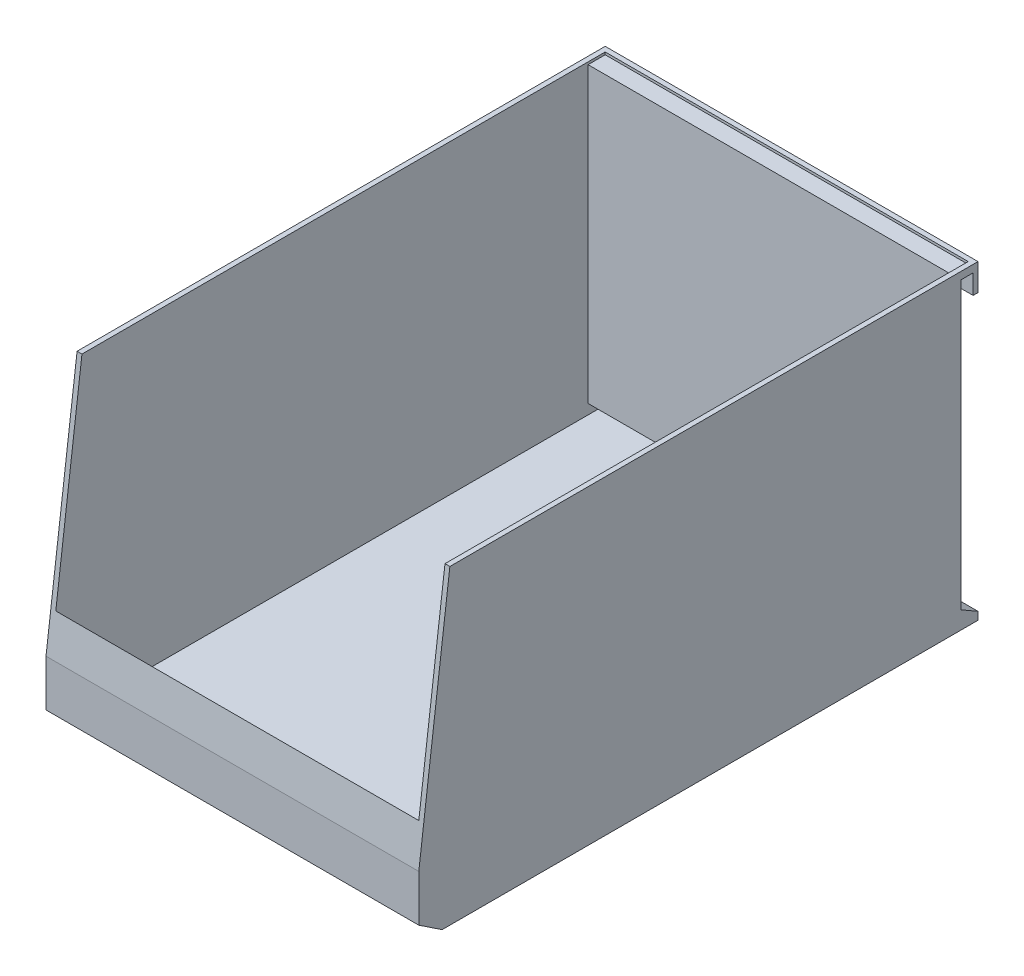
ISO-10303-21;
HEADER;
FILE_DESCRIPTION(('STEP AP214'),'2;1');
FILE_NAME('part.step','',(''),(''),'','','');
FILE_SCHEMA(('AUTOMOTIVE_DESIGN { 1 0 10303 214 1 1 1 1 }'));
ENDSEC;
DATA;
#1=APPLICATION_CONTEXT('core data for automotive mechanical design processes');
#2=APPLICATION_PROTOCOL_DEFINITION('international standard','automotive_design',2000,#1);
#3=PRODUCT_CONTEXT('',#1,'mechanical');
#4=PRODUCT('Part','Part','',(#3));
#5=PRODUCT_RELATED_PRODUCT_CATEGORY('part','',(#4));
#6=PRODUCT_DEFINITION_FORMATION('','',#4);
#7=PRODUCT_DEFINITION_CONTEXT('part definition',#1,'design');
#8=PRODUCT_DEFINITION('design','',#6,#7);
#9=PRODUCT_DEFINITION_SHAPE('','',#8);
#10=(LENGTH_UNIT() NAMED_UNIT(*) SI_UNIT(.MILLI.,.METRE.));
#11=(NAMED_UNIT(*) PLANE_ANGLE_UNIT() SI_UNIT($,.RADIAN.));
#12=(NAMED_UNIT(*) SI_UNIT($,.STERADIAN.) SOLID_ANGLE_UNIT());
#13=UNCERTAINTY_MEASURE_WITH_UNIT(LENGTH_MEASURE(1.E-05),#10,'distance_accuracy_value','');
#14=(GEOMETRIC_REPRESENTATION_CONTEXT(3) GLOBAL_UNCERTAINTY_ASSIGNED_CONTEXT((#13)) GLOBAL_UNIT_ASSIGNED_CONTEXT((#10,
#11,#12)) REPRESENTATION_CONTEXT('',''));
#15=CARTESIAN_POINT('',(0.,0.,0.));
#16=DIRECTION('',(0.,0.,1.));
#17=DIRECTION('',(1.,0.,0.));
#18=AXIS2_PLACEMENT_3D('',#15,#16,#17);
#19=CARTESIAN_POINT('',(0.,127.,0.));
#20=DIRECTION('',(0.,-1.,0.));
#21=DIRECTION('',(0.,0.,-1.));
#22=AXIS2_PLACEMENT_3D('',#19,#20,#21);
#23=PLANE('',#22);
#24=DIRECTION('',(0.,0.,1.));
#25=VECTOR('',#24,1.);
#26=CARTESIAN_POINT('',(-74.2,127.,0.));
#27=LINE('',#26,#25);
#28=CARTESIAN_POINT('',(-74.2,127.,-112.3));
#29=VERTEX_POINT('',#28);
#30=CARTESIAN_POINT('',(-74.2,127.,101.6));
#31=VERTEX_POINT('',#30);
#32=EDGE_CURVE('E205',#29,#31,#27,.T.);
#33=ORIENTED_EDGE('',*,*,#32,.F.);
#34=DIRECTION('',(-1.,0.,0.));
#35=VECTOR('',#34,1.);
#36=CARTESIAN_POINT('',(0.,127.,-112.3));
#37=LINE('',#36,#35);
#38=CARTESIAN_POINT('',(74.2,127.,-112.3));
#39=VERTEX_POINT('',#38);
#40=EDGE_CURVE('E209',#39,#29,#37,.T.);
#41=ORIENTED_EDGE('',*,*,#40,.F.);
#42=DIRECTION('',(0.,0.,-1.));
#43=VECTOR('',#42,1.);
#44=CARTESIAN_POINT('',(74.2,127.,0.));
#45=LINE('',#44,#43);
#46=CARTESIAN_POINT('',(74.2,127.,101.6));
#47=VERTEX_POINT('',#46);
#48=EDGE_CURVE('E245',#47,#39,#45,.T.);
#49=ORIENTED_EDGE('',*,*,#48,.F.);
#50=DIRECTION('',(1.,0.,0.));
#51=VECTOR('',#50,1.);
#52=CARTESIAN_POINT('',(-76.2,127.,101.6));
#53=LINE('',#52,#51);
#54=CARTESIAN_POINT('',(76.2,127.,101.6));
#55=VERTEX_POINT('',#54);
#56=EDGE_CURVE('E314',#47,#55,#53,.T.);
#57=ORIENTED_EDGE('',*,*,#56,.T.);
#58=DIRECTION('',(0.,0.,-1.));
#59=VECTOR('',#58,1.);
#60=CARTESIAN_POINT('',(76.2,127.,114.3));
#61=LINE('',#60,#59);
#62=CARTESIAN_POINT('',(76.2,127.,-114.3));
#63=VERTEX_POINT('',#62);
#64=EDGE_CURVE('E324',#55,#63,#61,.T.);
#65=ORIENTED_EDGE('',*,*,#64,.T.);
#66=DIRECTION('',(-1.,0.,0.));
#67=VECTOR('',#66,1.);
#68=CARTESIAN_POINT('',(-76.2,127.,-114.3));
#69=LINE('',#68,#67);
#70=CARTESIAN_POINT('',(-76.2,127.,-114.3));
#71=VERTEX_POINT('',#70);
#72=EDGE_CURVE('E326',#63,#71,#69,.T.);
#73=ORIENTED_EDGE('',*,*,#72,.T.);
#74=DIRECTION('',(0.,0.,1.));
#75=VECTOR('',#74,1.);
#76=CARTESIAN_POINT('',(-76.2,127.,114.3));
#77=LINE('',#76,#75);
#78=CARTESIAN_POINT('',(-76.2,127.,101.6));
#79=VERTEX_POINT('',#78);
#80=EDGE_CURVE('E329',#71,#79,#77,.T.);
#81=ORIENTED_EDGE('',*,*,#80,.T.);
#82=EDGE_CURVE('E310',#79,#31,#53,.T.);
#83=ORIENTED_EDGE('',*,*,#82,.T.);
#84=EDGE_LOOP('',(#33,#41,#49,#57,#65,#73,#81,#83));
#85=FACE_BOUND('',#84,.T.);
#86=ADVANCED_FACE('F33',(#85),#23,.F.);
#87=CARTESIAN_POINT('',(-76.2,127.,101.6));
#88=DIRECTION('',(0.,-0.124034734589209,-0.992277876713668));
#89=DIRECTION('',(0.,0.992277876713668,-0.124034734589209));
#90=AXIS2_PLACEMENT_3D('',#87,#88,#89);
#91=PLANE('',#90);
#92=DIRECTION('',(0.,0.992277876713668,-0.124034734589209));
#93=VECTOR('',#92,1.);
#94=CARTESIAN_POINT('',(74.2,127.,101.6));
#95=LINE('',#94,#93);
#96=CARTESIAN_POINT('',(74.2,41.4000000000001,112.3));
#97=VERTEX_POINT('',#96);
#98=EDGE_CURVE('E248',#97,#47,#95,.T.);
#99=ORIENTED_EDGE('',*,*,#98,.F.);
#100=DIRECTION('',(1.,0.,0.));
#101=VECTOR('',#100,1.);
#102=CARTESIAN_POINT('',(-76.2,41.4000000000001,112.3));
#103=LINE('',#102,#101);
#104=CARTESIAN_POINT('',(-74.2,41.4000000000001,112.3));
#105=VERTEX_POINT('',#104);
#106=EDGE_CURVE('E204',#105,#97,#103,.T.);
#107=ORIENTED_EDGE('',*,*,#106,.F.);
#108=DIRECTION('',(0.,0.992277876713668,-0.124034734589209));
#109=VECTOR('',#108,1.);
#110=CARTESIAN_POINT('',(-74.2,125.436923076923,101.795384615385));
#111=LINE('',#110,#109);
#112=EDGE_CURVE('E252',#105,#31,#111,.T.);
#113=ORIENTED_EDGE('',*,*,#112,.T.);
#114=ORIENTED_EDGE('',*,*,#82,.F.);
#115=DIRECTION('',(0.,0.992277876713668,-0.124034734589209));
#116=VECTOR('',#115,1.);
#117=CARTESIAN_POINT('',(-76.2,127.,101.6));
#118=LINE('',#117,#116);
#119=CARTESIAN_POINT('',(-76.2,25.4,114.3));
#120=VERTEX_POINT('',#119);
#121=EDGE_CURVE('E302',#120,#79,#118,.T.);
#122=ORIENTED_EDGE('',*,*,#121,.F.);
#123=DIRECTION('',(1.,0.,0.));
#124=VECTOR('',#123,1.);
#125=CARTESIAN_POINT('',(-76.2,25.4,114.3));
#126=LINE('',#125,#124);
#127=CARTESIAN_POINT('',(76.2,25.4,114.3));
#128=VERTEX_POINT('',#127);
#129=EDGE_CURVE('E305',#120,#128,#126,.T.);
#130=ORIENTED_EDGE('',*,*,#129,.T.);
#131=DIRECTION('',(0.,0.992277876713668,-0.124034734589209));
#132=VECTOR('',#131,1.);
#133=CARTESIAN_POINT('',(76.2,127.,101.6));
#134=LINE('',#133,#132);
#135=EDGE_CURVE('E306',#128,#55,#134,.T.);
#136=ORIENTED_EDGE('',*,*,#135,.T.);
#137=ORIENTED_EDGE('',*,*,#56,.F.);
#138=EDGE_LOOP('',(#99,#107,#113,#114,#122,#130,#136,#137));
#139=FACE_BOUND('',#138,.T.);
#140=ADVANCED_FACE('F407',(#139),#91,.F.);
#141=CARTESIAN_POINT('',(-76.2,127.,-114.3));
#142=DIRECTION('',(0.,0.,1.));
#143=DIRECTION('',(1.,0.,0.));
#144=AXIS2_PLACEMENT_3D('',#141,#142,#143);
#145=PLANE('',#144);
#146=DIRECTION('',(0.,-1.,0.));
#147=VECTOR('',#146,1.);
#148=CARTESIAN_POINT('',(76.2,127.,-114.3));
#149=LINE('',#148,#147);
#150=CARTESIAN_POINT('',(76.2,116.,-114.3));
#151=VERTEX_POINT('',#150);
#152=EDGE_CURVE('E11',#63,#151,#149,.T.);
#153=ORIENTED_EDGE('',*,*,#152,.T.);
#154=DIRECTION('',(1.,0.,0.));
#155=VECTOR('',#154,1.);
#156=CARTESIAN_POINT('',(-76.2,116.,-114.3));
#157=LINE('',#156,#155);
#158=CARTESIAN_POINT('',(-76.2,116.,-114.3));
#159=VERTEX_POINT('',#158);
#160=EDGE_CURVE('E296',#159,#151,#157,.T.);
#161=ORIENTED_EDGE('',*,*,#160,.F.);
#162=DIRECTION('',(0.,-1.,0.));
#163=VECTOR('',#162,1.);
#164=CARTESIAN_POINT('',(-76.2,127.,-114.3));
#165=LINE('',#164,#163);
#166=EDGE_CURVE('E345',#71,#159,#165,.T.);
#167=ORIENTED_EDGE('',*,*,#166,.F.);
#168=ORIENTED_EDGE('',*,*,#72,.F.);
#169=EDGE_LOOP('',(#153,#161,#167,#168));
#170=FACE_BOUND('',#169,.T.);
#171=ADVANCED_FACE('F380',(#170),#145,.F.);
#172=CARTESIAN_POINT('',(76.2,127.,114.3));
#173=DIRECTION('',(-1.,0.,0.));
#174=DIRECTION('',(0.,0.,1.));
#175=AXIS2_PLACEMENT_3D('',#172,#173,#174);
#176=PLANE('',#175);
#177=DIRECTION('',(0.,1.,0.));
#178=VECTOR('',#177,1.);
#179=CARTESIAN_POINT('',(76.2,124.,-112.3));
#180=LINE('',#179,#178);
#181=CARTESIAN_POINT('',(76.2,116.,-112.3));
#182=VERTEX_POINT('',#181);
#183=CARTESIAN_POINT('',(76.2,124.,-112.3));
#184=VERTEX_POINT('',#183);
#185=EDGE_CURVE('E284',#182,#184,#180,.T.);
#186=ORIENTED_EDGE('',*,*,#185,.F.);
#187=DIRECTION('',(0.,0.,1.));
#188=VECTOR('',#187,1.);
#189=CARTESIAN_POINT('',(76.2,116.,-112.3));
#190=LINE('',#189,#188);
#191=EDGE_CURVE('E281',#151,#182,#190,.T.);
#192=ORIENTED_EDGE('',*,*,#191,.F.);
#193=ORIENTED_EDGE('',*,*,#152,.F.);
#194=ORIENTED_EDGE('',*,*,#64,.F.);
#195=ORIENTED_EDGE('',*,*,#135,.F.);
#196=DIRECTION('',(0.,-1.,0.));
#197=VECTOR('',#196,1.);
#198=CARTESIAN_POINT('',(76.2,127.,114.3));
#199=LINE('',#198,#197);
#200=CARTESIAN_POINT('',(76.2,6.35,114.3));
#201=VERTEX_POINT('',#200);
#202=EDGE_CURVE('E332',#128,#201,#199,.T.);
#203=ORIENTED_EDGE('',*,*,#202,.T.);
#204=DIRECTION('',(0.,0.554700196225228,0.832050294337844));
#205=VECTOR('',#204,1.);
#206=CARTESIAN_POINT('',(76.2,6.35,114.3));
#207=LINE('',#206,#205);
#208=CARTESIAN_POINT('',(76.2,0.,104.775));
#209=VERTEX_POINT('',#208);
#210=EDGE_CURVE('E291',#209,#201,#207,.T.);
#211=ORIENTED_EDGE('',*,*,#210,.F.);
#212=DIRECTION('',(0.,0.,-1.));
#213=VECTOR('',#212,1.);
#214=CARTESIAN_POINT('',(76.2,0.,114.3));
#215=LINE('',#214,#213);
#216=CARTESIAN_POINT('',(76.2,0.,-114.3));
#217=VERTEX_POINT('',#216);
#218=EDGE_CURVE('E313',#209,#217,#215,.T.);
#219=ORIENTED_EDGE('',*,*,#218,.T.);
#220=CARTESIAN_POINT('',(76.2,3.175,-114.3));
#221=VERTEX_POINT('',#220);
#222=EDGE_CURVE('E41',#221,#217,#149,.T.);
#223=ORIENTED_EDGE('',*,*,#222,.F.);
#224=DIRECTION('',(0.,-0.499999999999995,-0.866025403784442));
#225=VECTOR('',#224,1.);
#226=CARTESIAN_POINT('',(76.2,7.21645188432733,-107.3));
#227=LINE('',#226,#225);
#228=CARTESIAN_POINT('',(76.2,7.21645188432733,-107.3));
#229=VERTEX_POINT('',#228);
#230=EDGE_CURVE('E279',#229,#221,#227,.T.);
#231=ORIENTED_EDGE('',*,*,#230,.F.);
#232=DIRECTION('',(0.,-1.,0.));
#233=VECTOR('',#232,1.);
#234=CARTESIAN_POINT('',(76.2,7.21645188432733,-107.3));
#235=LINE('',#234,#233);
#236=CARTESIAN_POINT('',(76.2,124.,-107.3));
#237=VERTEX_POINT('',#236);
#238=EDGE_CURVE('E261',#237,#229,#235,.T.);
#239=ORIENTED_EDGE('',*,*,#238,.F.);
#240=DIRECTION('',(0.,0.,1.));
#241=VECTOR('',#240,1.);
#242=CARTESIAN_POINT('',(76.2,124.,-107.3));
#243=LINE('',#242,#241);
#244=EDGE_CURVE('E265',#184,#237,#243,.T.);
#245=ORIENTED_EDGE('',*,*,#244,.F.);
#246=EDGE_LOOP('',(#186,#192,#193,#194,#195,#203,#211,#219,#223,#231,#239,#245));
#247=FACE_BOUND('',#246,.T.);
#248=ADVANCED_FACE('F35',(#247),#176,.F.);
#249=CARTESIAN_POINT('',(-76.2,3.175,-114.3));
#250=VERTEX_POINT('',#249);
#251=CARTESIAN_POINT('',(-76.2,0.,-114.3));
#252=VERTEX_POINT('',#251);
#253=EDGE_CURVE('E344',#250,#252,#165,.T.);
#254=ORIENTED_EDGE('',*,*,#253,.F.);
#255=DIRECTION('',(1.,0.,0.));
#256=VECTOR('',#255,1.);
#257=CARTESIAN_POINT('',(-76.2,3.175,-114.3));
#258=LINE('',#257,#256);
#259=EDGE_CURVE('E298',#250,#221,#258,.T.);
#260=ORIENTED_EDGE('',*,*,#259,.T.);
#261=ORIENTED_EDGE('',*,*,#222,.T.);
#262=DIRECTION('',(-1.,0.,0.));
#263=VECTOR('',#262,1.);
#264=CARTESIAN_POINT('',(-76.2,0.,-114.3));
#265=LINE('',#264,#263);
#266=EDGE_CURVE('E335',#217,#252,#265,.T.);
#267=ORIENTED_EDGE('',*,*,#266,.T.);
#268=EDGE_LOOP('',(#254,#260,#261,#267));
#269=FACE_BOUND('',#268,.T.);
#270=ADVANCED_FACE('F355',(#269),#145,.F.);
#271=CARTESIAN_POINT('',(-76.2,127.,114.3));
#272=DIRECTION('',(1.,0.,0.));
#273=DIRECTION('',(0.,0.,-1.));
#274=AXIS2_PLACEMENT_3D('',#271,#272,#273);
#275=PLANE('',#274);
#276=ORIENTED_EDGE('',*,*,#166,.T.);
#277=DIRECTION('',(0.,0.,1.));
#278=VECTOR('',#277,1.);
#279=CARTESIAN_POINT('',(-76.2,116.,-112.3));
#280=LINE('',#279,#278);
#281=CARTESIAN_POINT('',(-76.2,116.,-112.3));
#282=VERTEX_POINT('',#281);
#283=EDGE_CURVE('E267',#159,#282,#280,.T.);
#284=ORIENTED_EDGE('',*,*,#283,.T.);
#285=DIRECTION('',(0.,1.,0.));
#286=VECTOR('',#285,1.);
#287=CARTESIAN_POINT('',(-76.2,124.,-112.3));
#288=LINE('',#287,#286);
#289=CARTESIAN_POINT('',(-76.2,124.,-112.3));
#290=VERTEX_POINT('',#289);
#291=EDGE_CURVE('E270',#282,#290,#288,.T.);
#292=ORIENTED_EDGE('',*,*,#291,.T.);
#293=DIRECTION('',(0.,0.,1.));
#294=VECTOR('',#293,1.);
#295=CARTESIAN_POINT('',(-76.2,124.,-107.3));
#296=LINE('',#295,#294);
#297=CARTESIAN_POINT('',(-76.2,124.,-107.3));
#298=VERTEX_POINT('',#297);
#299=EDGE_CURVE('E273',#290,#298,#296,.T.);
#300=ORIENTED_EDGE('',*,*,#299,.T.);
#301=DIRECTION('',(0.,-1.,0.));
#302=VECTOR('',#301,1.);
#303=CARTESIAN_POINT('',(-76.2,116.,-107.3));
#304=LINE('',#303,#302);
#305=CARTESIAN_POINT('',(-76.2,7.21645188432733,-107.3));
#306=VERTEX_POINT('',#305);
#307=EDGE_CURVE('E262',#298,#306,#304,.T.);
#308=ORIENTED_EDGE('',*,*,#307,.T.);
#309=DIRECTION('',(0.,-0.499999999999995,-0.866025403784442));
#310=VECTOR('',#309,1.);
#311=CARTESIAN_POINT('',(-76.2,7.21645188432733,-107.3));
#312=LINE('',#311,#310);
#313=EDGE_CURVE('E56',#306,#250,#312,.T.);
#314=ORIENTED_EDGE('',*,*,#313,.T.);
#315=ORIENTED_EDGE('',*,*,#253,.T.);
#316=DIRECTION('',(0.,0.,1.));
#317=VECTOR('',#316,1.);
#318=CARTESIAN_POINT('',(-76.2,0.,114.3));
#319=LINE('',#318,#317);
#320=CARTESIAN_POINT('',(-76.2,0.,104.775));
#321=VERTEX_POINT('',#320);
#322=EDGE_CURVE('E327',#252,#321,#319,.T.);
#323=ORIENTED_EDGE('',*,*,#322,.T.);
#324=DIRECTION('',(0.,0.554700196225228,0.832050294337844));
#325=VECTOR('',#324,1.);
#326=CARTESIAN_POINT('',(-76.2,6.35,114.3));
#327=LINE('',#326,#325);
#328=CARTESIAN_POINT('',(-76.2,6.35,114.3));
#329=VERTEX_POINT('',#328);
#330=EDGE_CURVE('E316',#321,#329,#327,.T.);
#331=ORIENTED_EDGE('',*,*,#330,.T.);
#332=DIRECTION('',(0.,-1.,0.));
#333=VECTOR('',#332,1.);
#334=CARTESIAN_POINT('',(-76.2,127.,114.3));
#335=LINE('',#334,#333);
#336=EDGE_CURVE('E342',#120,#329,#335,.T.);
#337=ORIENTED_EDGE('',*,*,#336,.F.);
#338=ORIENTED_EDGE('',*,*,#121,.T.);
#339=ORIENTED_EDGE('',*,*,#80,.F.);
#340=EDGE_LOOP('',(#276,#284,#292,#300,#308,#314,#315,#323,#331,#337,#338,#339));
#341=FACE_BOUND('',#340,.T.);
#342=ADVANCED_FACE('F351',(#341),#275,.F.);
#343=CARTESIAN_POINT('',(-76.2,127.,114.3));
#344=DIRECTION('',(0.,0.,-1.));
#345=DIRECTION('',(-1.,0.,0.));
#346=AXIS2_PLACEMENT_3D('',#343,#344,#345);
#347=PLANE('',#346);
#348=ORIENTED_EDGE('',*,*,#202,.F.);
#349=ORIENTED_EDGE('',*,*,#129,.F.);
#350=ORIENTED_EDGE('',*,*,#336,.T.);
#351=DIRECTION('',(1.,0.,0.));
#352=VECTOR('',#351,1.);
#353=CARTESIAN_POINT('',(-76.2,6.35,114.3));
#354=LINE('',#353,#352);
#355=EDGE_CURVE('E319',#329,#201,#354,.T.);
#356=ORIENTED_EDGE('',*,*,#355,.T.);
#357=EDGE_LOOP('',(#348,#349,#350,#356));
#358=FACE_BOUND('',#357,.T.);
#359=ADVANCED_FACE('F371',(#358),#347,.F.);
#360=CARTESIAN_POINT('',(0.,0.,0.));
#361=DIRECTION('',(0.,-1.,0.));
#362=DIRECTION('',(0.,0.,-1.));
#363=AXIS2_PLACEMENT_3D('',#360,#361,#362);
#364=PLANE('',#363);
#365=DIRECTION('',(1.,0.,0.));
#366=VECTOR('',#365,1.);
#367=CARTESIAN_POINT('',(-76.2,0.,104.775));
#368=LINE('',#367,#366);
#369=EDGE_CURVE('E309',#321,#209,#368,.T.);
#370=ORIENTED_EDGE('',*,*,#369,.F.);
#371=ORIENTED_EDGE('',*,*,#322,.F.);
#372=ORIENTED_EDGE('',*,*,#266,.F.);
#373=ORIENTED_EDGE('',*,*,#218,.F.);
#374=EDGE_LOOP('',(#370,#371,#372,#373));
#375=FACE_BOUND('',#374,.T.);
#376=ADVANCED_FACE('F360',(#375),#364,.T.);
#377=CARTESIAN_POINT('',(-76.2,6.35,114.3));
#378=DIRECTION('',(0.,0.832050294337844,-0.554700196225228));
#379=DIRECTION('',(0.,0.554700196225228,0.832050294337844));
#380=AXIS2_PLACEMENT_3D('',#377,#378,#379);
#381=PLANE('',#380);
#382=ORIENTED_EDGE('',*,*,#210,.T.);
#383=ORIENTED_EDGE('',*,*,#355,.F.);
#384=ORIENTED_EDGE('',*,*,#330,.F.);
#385=ORIENTED_EDGE('',*,*,#369,.T.);
#386=EDGE_LOOP('',(#382,#383,#384,#385));
#387=FACE_BOUND('',#386,.T.);
#388=ADVANCED_FACE('F363',(#387),#381,.F.);
#389=CARTESIAN_POINT('',(-76.2,124.,-107.3));
#390=DIRECTION('',(0.,1.,0.));
#391=DIRECTION('',(0.,0.,1.));
#392=AXIS2_PLACEMENT_3D('',#389,#390,#391);
#393=PLANE('',#392);
#394=ORIENTED_EDGE('',*,*,#244,.T.);
#395=DIRECTION('',(1.,0.,0.));
#396=VECTOR('',#395,1.);
#397=CARTESIAN_POINT('',(-76.2,124.,-107.3));
#398=LINE('',#397,#396);
#399=EDGE_CURVE('E289',#298,#237,#398,.T.);
#400=ORIENTED_EDGE('',*,*,#399,.F.);
#401=ORIENTED_EDGE('',*,*,#299,.F.);
#402=DIRECTION('',(1.,0.,0.));
#403=VECTOR('',#402,1.);
#404=CARTESIAN_POINT('',(-76.2,124.,-112.3));
#405=LINE('',#404,#403);
#406=EDGE_CURVE('E292',#290,#184,#405,.T.);
#407=ORIENTED_EDGE('',*,*,#406,.T.);
#408=EDGE_LOOP('',(#394,#400,#401,#407));
#409=FACE_BOUND('',#408,.T.);
#410=ADVANCED_FACE('F392',(#409),#393,.F.);
#411=CARTESIAN_POINT('',(-76.2,124.,-112.3));
#412=DIRECTION('',(0.,0.,-1.));
#413=DIRECTION('',(-1.,0.,0.));
#414=AXIS2_PLACEMENT_3D('',#411,#412,#413);
#415=PLANE('',#414);
#416=ORIENTED_EDGE('',*,*,#185,.T.);
#417=ORIENTED_EDGE('',*,*,#406,.F.);
#418=ORIENTED_EDGE('',*,*,#291,.F.);
#419=DIRECTION('',(1.,0.,0.));
#420=VECTOR('',#419,1.);
#421=CARTESIAN_POINT('',(-76.2,116.,-112.3));
#422=LINE('',#421,#420);
#423=EDGE_CURVE('E294',#282,#182,#422,.T.);
#424=ORIENTED_EDGE('',*,*,#423,.T.);
#425=EDGE_LOOP('',(#416,#417,#418,#424));
#426=FACE_BOUND('',#425,.T.);
#427=ADVANCED_FACE('F387',(#426),#415,.F.);
#428=CARTESIAN_POINT('',(-76.2,116.,-112.3));
#429=DIRECTION('',(0.,1.,0.));
#430=DIRECTION('',(0.,0.,1.));
#431=AXIS2_PLACEMENT_3D('',#428,#429,#430);
#432=PLANE('',#431);
#433=ORIENTED_EDGE('',*,*,#191,.T.);
#434=ORIENTED_EDGE('',*,*,#423,.F.);
#435=ORIENTED_EDGE('',*,*,#283,.F.);
#436=ORIENTED_EDGE('',*,*,#160,.T.);
#437=EDGE_LOOP('',(#433,#434,#435,#436));
#438=FACE_BOUND('',#437,.T.);
#439=ADVANCED_FACE('F383',(#438),#432,.F.);
#440=CARTESIAN_POINT('',(-76.2,7.21645188432733,-107.3));
#441=DIRECTION('',(0.,-0.866025403784442,0.499999999999995));
#442=DIRECTION('',(0.,-0.499999999999995,-0.866025403784442));
#443=AXIS2_PLACEMENT_3D('',#440,#441,#442);
#444=PLANE('',#443);
#445=ORIENTED_EDGE('',*,*,#230,.T.);
#446=ORIENTED_EDGE('',*,*,#259,.F.);
#447=ORIENTED_EDGE('',*,*,#313,.F.);
#448=DIRECTION('',(1.,0.,0.));
#449=VECTOR('',#448,1.);
#450=CARTESIAN_POINT('',(-76.2,7.21645188432733,-107.3));
#451=LINE('',#450,#449);
#452=EDGE_CURVE('E276',#306,#229,#451,.T.);
#453=ORIENTED_EDGE('',*,*,#452,.T.);
#454=EDGE_LOOP('',(#445,#446,#447,#453));
#455=FACE_BOUND('',#454,.T.);
#456=ADVANCED_FACE('F396',(#455),#444,.F.);
#457=CARTESIAN_POINT('',(-76.2,7.21645188432733,-107.3));
#458=DIRECTION('',(0.,0.,1.));
#459=DIRECTION('',(1.,0.,0.));
#460=AXIS2_PLACEMENT_3D('',#457,#458,#459);
#461=PLANE('',#460);
#462=ORIENTED_EDGE('',*,*,#238,.T.);
#463=ORIENTED_EDGE('',*,*,#452,.F.);
#464=ORIENTED_EDGE('',*,*,#307,.F.);
#465=ORIENTED_EDGE('',*,*,#399,.T.);
#466=EDGE_LOOP('',(#462,#463,#464,#465));
#467=FACE_BOUND('',#466,.T.);
#468=ADVANCED_FACE('F394',(#467),#461,.F.);
#469=CARTESIAN_POINT('',(-76.2,127.,-112.3));
#470=DIRECTION('',(0.,0.,1.));
#471=DIRECTION('',(1.,0.,0.));
#472=AXIS2_PLACEMENT_3D('',#469,#470,#471);
#473=PLANE('',#472);
#474=DIRECTION('',(1.,0.,0.));
#475=VECTOR('',#474,1.);
#476=CARTESIAN_POINT('',(-76.2,126.,-112.3));
#477=LINE('',#476,#475);
#478=CARTESIAN_POINT('',(-74.2,126.,-112.3));
#479=VERTEX_POINT('',#478);
#480=CARTESIAN_POINT('',(74.2,126.,-112.3));
#481=VERTEX_POINT('',#480);
#482=EDGE_CURVE('E259',#479,#481,#477,.T.);
#483=ORIENTED_EDGE('',*,*,#482,.T.);
#484=DIRECTION('',(0.,-1.,0.));
#485=VECTOR('',#484,1.);
#486=CARTESIAN_POINT('',(74.2,127.,-112.3));
#487=LINE('',#486,#485);
#488=EDGE_CURVE('E219',#39,#481,#487,.T.);
#489=ORIENTED_EDGE('',*,*,#488,.F.);
#490=ORIENTED_EDGE('',*,*,#40,.T.);
#491=DIRECTION('',(0.,-1.,0.));
#492=VECTOR('',#491,1.);
#493=CARTESIAN_POINT('',(-74.2,127.,-112.3));
#494=LINE('',#493,#492);
#495=EDGE_CURVE('E212',#29,#479,#494,.T.);
#496=ORIENTED_EDGE('',*,*,#495,.T.);
#497=EDGE_LOOP('',(#483,#489,#490,#496));
#498=FACE_BOUND('',#497,.T.);
#499=ADVANCED_FACE('F403',(#498),#473,.T.);
#500=CARTESIAN_POINT('',(74.2,127.,114.3));
#501=DIRECTION('',(-1.,0.,0.));
#502=DIRECTION('',(0.,0.,1.));
#503=AXIS2_PLACEMENT_3D('',#500,#501,#502);
#504=PLANE('',#503);
#505=DIRECTION('',(0.,0.,1.));
#506=VECTOR('',#505,1.);
#507=CARTESIAN_POINT('',(74.2,126.,-107.3));
#508=LINE('',#507,#506);
#509=CARTESIAN_POINT('',(74.2,126.,-105.3));
#510=VERTEX_POINT('',#509);
#511=EDGE_CURVE('E222',#481,#510,#508,.T.);
#512=ORIENTED_EDGE('',*,*,#511,.T.);
#513=DIRECTION('',(0.,-1.,0.));
#514=VECTOR('',#513,1.);
#515=CARTESIAN_POINT('',(74.2,7.21645188432733,-105.3));
#516=LINE('',#515,#514);
#517=CARTESIAN_POINT('',(74.2,6.06175134594808,-105.3));
#518=VERTEX_POINT('',#517);
#519=EDGE_CURVE('E223',#510,#518,#516,.T.);
#520=ORIENTED_EDGE('',*,*,#519,.T.);
#521=DIRECTION('',(0.,-0.499999999999995,-0.866025403784442));
#522=VECTOR('',#521,1.);
#523=CARTESIAN_POINT('',(74.2,5.48440107675845,-106.3));
#524=LINE('',#523,#522);
#525=CARTESIAN_POINT('',(74.2,2.02029946162075,-112.3));
#526=VERTEX_POINT('',#525);
#527=EDGE_CURVE('E220',#518,#526,#524,.T.);
#528=ORIENTED_EDGE('',*,*,#527,.T.);
#529=DIRECTION('',(0.,-1.,0.));
#530=VECTOR('',#529,1.);
#531=CARTESIAN_POINT('',(74.2,127.,-112.3));
#532=LINE('',#531,#530);
#533=CARTESIAN_POINT('',(74.2,2.,-112.3));
#534=VERTEX_POINT('',#533);
#535=EDGE_CURVE('E217',#526,#534,#532,.T.);
#536=ORIENTED_EDGE('',*,*,#535,.T.);
#537=DIRECTION('',(0.,0.,-1.));
#538=VECTOR('',#537,1.);
#539=CARTESIAN_POINT('',(74.2,2.,0.));
#540=LINE('',#539,#538);
#541=CARTESIAN_POINT('',(74.2,2.,104.169448724536));
#542=VERTEX_POINT('',#541);
#543=EDGE_CURVE('E191',#542,#534,#540,.T.);
#544=ORIENTED_EDGE('',*,*,#543,.F.);
#545=DIRECTION('',(0.,0.554700196225228,0.832050294337844));
#546=VECTOR('',#545,1.);
#547=CARTESIAN_POINT('',(74.2,8.01410058867569,113.19059960755));
#548=LINE('',#547,#546);
#549=CARTESIAN_POINT('',(74.2,7.42036751697598,112.3));
#550=VERTEX_POINT('',#549);
#551=EDGE_CURVE('E183',#542,#550,#548,.T.);
#552=ORIENTED_EDGE('',*,*,#551,.T.);
#553=DIRECTION('',(0.,-1.,0.));
#554=VECTOR('',#553,1.);
#555=CARTESIAN_POINT('',(74.2,127.,112.3));
#556=LINE('',#555,#554);
#557=EDGE_CURVE('E188',#97,#550,#556,.T.);
#558=ORIENTED_EDGE('',*,*,#557,.F.);
#559=ORIENTED_EDGE('',*,*,#98,.T.);
#560=ORIENTED_EDGE('',*,*,#48,.T.);
#561=ORIENTED_EDGE('',*,*,#488,.T.);
#562=EDGE_LOOP('',(#512,#520,#528,#536,#544,#552,#558,#559,#560,#561));
#563=FACE_BOUND('',#562,.T.);
#564=ADVANCED_FACE('F186',(#563),#504,.T.);
#565=DIRECTION('',(0.,-1.,0.));
#566=VECTOR('',#565,1.);
#567=CARTESIAN_POINT('',(-74.2,127.,-112.3));
#568=LINE('',#567,#566);
#569=CARTESIAN_POINT('',(-74.2,2.02029946162075,-112.3));
#570=VERTEX_POINT('',#569);
#571=CARTESIAN_POINT('',(-74.2,2.,-112.3));
#572=VERTEX_POINT('',#571);
#573=EDGE_CURVE('E207',#570,#572,#568,.T.);
#574=ORIENTED_EDGE('',*,*,#573,.T.);
#575=DIRECTION('',(-1.,0.,0.));
#576=VECTOR('',#575,1.);
#577=CARTESIAN_POINT('',(0.,2.,-112.3));
#578=LINE('',#577,#576);
#579=EDGE_CURVE('E216',#534,#572,#578,.T.);
#580=ORIENTED_EDGE('',*,*,#579,.F.);
#581=ORIENTED_EDGE('',*,*,#535,.F.);
#582=DIRECTION('',(1.,0.,0.));
#583=VECTOR('',#582,1.);
#584=CARTESIAN_POINT('',(-76.2,2.02029946162074,-112.3));
#585=LINE('',#584,#583);
#586=EDGE_CURVE('E229',#570,#526,#585,.T.);
#587=ORIENTED_EDGE('',*,*,#586,.F.);
#588=EDGE_LOOP('',(#574,#580,#581,#587));
#589=FACE_BOUND('',#588,.T.);
#590=ADVANCED_FACE('F498',(#589),#473,.T.);
#591=CARTESIAN_POINT('',(-74.2,127.,114.3));
#592=DIRECTION('',(1.,0.,0.));
#593=DIRECTION('',(0.,0.,-1.));
#594=AXIS2_PLACEMENT_3D('',#591,#592,#593);
#595=PLANE('',#594);
#596=ORIENTED_EDGE('',*,*,#495,.F.);
#597=ORIENTED_EDGE('',*,*,#32,.T.);
#598=ORIENTED_EDGE('',*,*,#112,.F.);
#599=DIRECTION('',(0.,-1.,0.));
#600=VECTOR('',#599,1.);
#601=CARTESIAN_POINT('',(-74.2,127.,112.3));
#602=LINE('',#601,#600);
#603=CARTESIAN_POINT('',(-74.2,7.42036751697598,112.3));
#604=VERTEX_POINT('',#603);
#605=EDGE_CURVE('E48',#105,#604,#602,.T.);
#606=ORIENTED_EDGE('',*,*,#605,.T.);
#607=DIRECTION('',(0.,0.554700196225228,0.832050294337844));
#608=VECTOR('',#607,1.);
#609=CARTESIAN_POINT('',(-74.2,45.1371775117525,168.875214992165));
#610=LINE('',#609,#608);
#611=CARTESIAN_POINT('',(-74.2,2.,104.169448724536));
#612=VERTEX_POINT('',#611);
#613=EDGE_CURVE('E194',#612,#604,#610,.T.);
#614=ORIENTED_EDGE('',*,*,#613,.F.);
#615=DIRECTION('',(0.,0.,1.));
#616=VECTOR('',#615,1.);
#617=CARTESIAN_POINT('',(-74.2,2.,0.));
#618=LINE('',#617,#616);
#619=EDGE_CURVE('E235',#572,#612,#618,.T.);
#620=ORIENTED_EDGE('',*,*,#619,.F.);
#621=ORIENTED_EDGE('',*,*,#573,.F.);
#622=DIRECTION('',(0.,-0.499999999999995,-0.866025403784442));
#623=VECTOR('',#622,1.);
#624=CARTESIAN_POINT('',(-74.2,131.385902844991,111.767797811805));
#625=LINE('',#624,#623);
#626=CARTESIAN_POINT('',(-74.2,6.06175134594808,-105.3));
#627=VERTEX_POINT('',#626);
#628=EDGE_CURVE('E238',#627,#570,#625,.T.);
#629=ORIENTED_EDGE('',*,*,#628,.F.);
#630=DIRECTION('',(0.,-1.,0.));
#631=VECTOR('',#630,1.);
#632=CARTESIAN_POINT('',(-74.2,127.,-105.3));
#633=LINE('',#632,#631);
#634=CARTESIAN_POINT('',(-74.2,126.,-105.3));
#635=VERTEX_POINT('',#634);
#636=EDGE_CURVE('E227',#635,#627,#633,.T.);
#637=ORIENTED_EDGE('',*,*,#636,.F.);
#638=DIRECTION('',(0.,0.,1.));
#639=VECTOR('',#638,1.);
#640=CARTESIAN_POINT('',(-74.2,126.,114.3));
#641=LINE('',#640,#639);
#642=EDGE_CURVE('E236',#479,#635,#641,.T.);
#643=ORIENTED_EDGE('',*,*,#642,.F.);
#644=EDGE_LOOP('',(#596,#597,#598,#606,#614,#620,#621,#629,#637,#643));
#645=FACE_BOUND('',#644,.T.);
#646=ADVANCED_FACE('F514',(#645),#595,.T.);
#647=CARTESIAN_POINT('',(-76.2,127.,112.3));
#648=DIRECTION('',(0.,0.,-1.));
#649=DIRECTION('',(-1.,0.,0.));
#650=AXIS2_PLACEMENT_3D('',#647,#648,#649);
#651=PLANE('',#650);
#652=ORIENTED_EDGE('',*,*,#557,.T.);
#653=DIRECTION('',(1.,0.,0.));
#654=VECTOR('',#653,1.);
#655=CARTESIAN_POINT('',(-76.2,7.42036751697597,112.3));
#656=LINE('',#655,#654);
#657=EDGE_CURVE('E198',#604,#550,#656,.T.);
#658=ORIENTED_EDGE('',*,*,#657,.F.);
#659=ORIENTED_EDGE('',*,*,#605,.F.);
#660=ORIENTED_EDGE('',*,*,#106,.T.);
#661=EDGE_LOOP('',(#652,#658,#659,#660));
#662=FACE_BOUND('',#661,.T.);
#663=ADVANCED_FACE('F202',(#662),#651,.T.);
#664=CARTESIAN_POINT('',(0.,2.,0.));
#665=DIRECTION('',(0.,-1.,0.));
#666=DIRECTION('',(0.,0.,-1.));
#667=AXIS2_PLACEMENT_3D('',#664,#665,#666);
#668=PLANE('',#667);
#669=DIRECTION('',(1.,0.,0.));
#670=VECTOR('',#669,1.);
#671=CARTESIAN_POINT('',(0.,2.,104.169448724536));
#672=LINE('',#671,#670);
#673=EDGE_CURVE('E200',#612,#542,#672,.T.);
#674=ORIENTED_EDGE('',*,*,#673,.T.);
#675=ORIENTED_EDGE('',*,*,#543,.T.);
#676=ORIENTED_EDGE('',*,*,#579,.T.);
#677=ORIENTED_EDGE('',*,*,#619,.T.);
#678=EDGE_LOOP('',(#674,#675,#676,#677));
#679=FACE_BOUND('',#678,.T.);
#680=ADVANCED_FACE('F532',(#679),#668,.F.);
#681=CARTESIAN_POINT('',(-76.2,8.01410058867569,113.19059960755));
#682=DIRECTION('',(0.,0.832050294337844,-0.554700196225228));
#683=DIRECTION('',(0.,0.554700196225228,0.832050294337844));
#684=AXIS2_PLACEMENT_3D('',#681,#682,#683);
#685=PLANE('',#684);
#686=ORIENTED_EDGE('',*,*,#551,.F.);
#687=ORIENTED_EDGE('',*,*,#673,.F.);
#688=ORIENTED_EDGE('',*,*,#613,.T.);
#689=ORIENTED_EDGE('',*,*,#657,.T.);
#690=EDGE_LOOP('',(#686,#687,#688,#689));
#691=FACE_BOUND('',#690,.T.);
#692=ADVANCED_FACE('F199',(#691),#685,.T.);
#693=CARTESIAN_POINT('',(-76.2,126.,-107.3));
#694=DIRECTION('',(0.,1.,0.));
#695=DIRECTION('',(0.,0.,1.));
#696=AXIS2_PLACEMENT_3D('',#693,#694,#695);
#697=PLANE('',#696);
#698=ORIENTED_EDGE('',*,*,#642,.T.);
#699=DIRECTION('',(1.,0.,0.));
#700=VECTOR('',#699,1.);
#701=CARTESIAN_POINT('',(-76.2,126.,-105.3));
#702=LINE('',#701,#700);
#703=EDGE_CURVE('E195',#635,#510,#702,.T.);
#704=ORIENTED_EDGE('',*,*,#703,.T.);
#705=ORIENTED_EDGE('',*,*,#511,.F.);
#706=ORIENTED_EDGE('',*,*,#482,.F.);
#707=EDGE_LOOP('',(#698,#704,#705,#706));
#708=FACE_BOUND('',#707,.T.);
#709=ADVANCED_FACE('F550',(#708),#697,.T.);
#710=CARTESIAN_POINT('',(-76.2,5.48440107675845,-106.3));
#711=DIRECTION('',(0.,-0.866025403784442,0.499999999999995));
#712=DIRECTION('',(0.,-0.499999999999995,-0.866025403784442));
#713=AXIS2_PLACEMENT_3D('',#710,#711,#712);
#714=PLANE('',#713);
#715=ORIENTED_EDGE('',*,*,#527,.F.);
#716=DIRECTION('',(1.,0.,0.));
#717=VECTOR('',#716,1.);
#718=CARTESIAN_POINT('',(-76.2,6.06175134594808,-105.3));
#719=LINE('',#718,#717);
#720=EDGE_CURVE('E232',#627,#518,#719,.T.);
#721=ORIENTED_EDGE('',*,*,#720,.F.);
#722=ORIENTED_EDGE('',*,*,#628,.T.);
#723=ORIENTED_EDGE('',*,*,#586,.T.);
#724=EDGE_LOOP('',(#715,#721,#722,#723));
#725=FACE_BOUND('',#724,.T.);
#726=ADVANCED_FACE('F559',(#725),#714,.T.);
#727=CARTESIAN_POINT('',(-76.2,7.21645188432733,-105.3));
#728=DIRECTION('',(0.,0.,1.));
#729=DIRECTION('',(1.,0.,0.));
#730=AXIS2_PLACEMENT_3D('',#727,#728,#729);
#731=PLANE('',#730);
#732=ORIENTED_EDGE('',*,*,#519,.F.);
#733=ORIENTED_EDGE('',*,*,#703,.F.);
#734=ORIENTED_EDGE('',*,*,#636,.T.);
#735=ORIENTED_EDGE('',*,*,#720,.T.);
#736=EDGE_LOOP('',(#732,#733,#734,#735));
#737=FACE_BOUND('',#736,.T.);
#738=ADVANCED_FACE('F569',(#737),#731,.T.);
#739=CLOSED_SHELL('',(#86,#140,#171,#248,#270,#342,#359,#376,#388,#410,#427,#439,#456,#468,#499,
#564,#590,#646,#663,#680,#692,#709,#726,#738));
#740=MANIFOLD_SOLID_BREP('B2',#739);
#741=ADVANCED_BREP_SHAPE_REPRESENTATION('',(#18,#740),#14);
#742=SHAPE_DEFINITION_REPRESENTATION(#9,#741);
ENDSEC;
END-ISO-10303-21;
